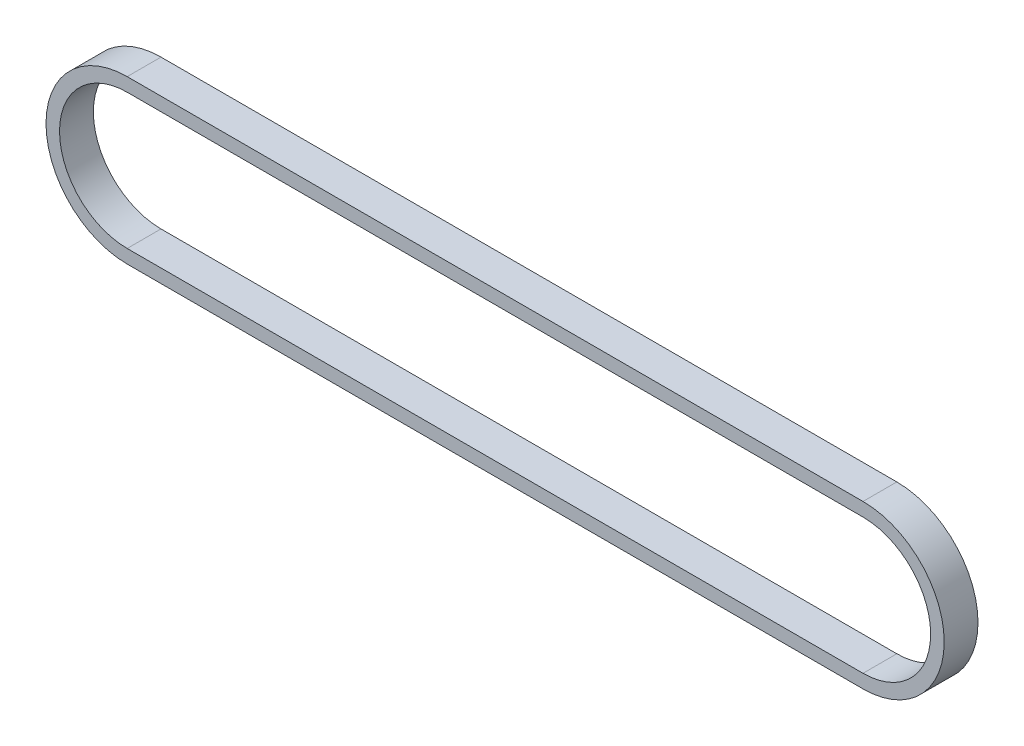
ISO-10303-21;
HEADER;
FILE_DESCRIPTION(('STEP AP214'),'2;1');
FILE_NAME('part.step','',(''),(''),'','','');
FILE_SCHEMA(('AUTOMOTIVE_DESIGN { 1 0 10303 214 1 1 1 1 }'));
ENDSEC;
DATA;
#1=APPLICATION_CONTEXT('core data for automotive mechanical design processes');
#2=APPLICATION_PROTOCOL_DEFINITION('international standard','automotive_design',2000,#1);
#3=PRODUCT_CONTEXT('',#1,'mechanical');
#4=PRODUCT('Part','Part','',(#3));
#5=PRODUCT_RELATED_PRODUCT_CATEGORY('part','',(#4));
#6=PRODUCT_DEFINITION_FORMATION('','',#4);
#7=PRODUCT_DEFINITION_CONTEXT('part definition',#1,'design');
#8=PRODUCT_DEFINITION('design','',#6,#7);
#9=PRODUCT_DEFINITION_SHAPE('','',#8);
#10=(LENGTH_UNIT() NAMED_UNIT(*) SI_UNIT(.MILLI.,.METRE.));
#11=(NAMED_UNIT(*) PLANE_ANGLE_UNIT() SI_UNIT($,.RADIAN.));
#12=(NAMED_UNIT(*) SI_UNIT($,.STERADIAN.) SOLID_ANGLE_UNIT());
#13=UNCERTAINTY_MEASURE_WITH_UNIT(LENGTH_MEASURE(1.E-05),#10,'distance_accuracy_value','');
#14=(GEOMETRIC_REPRESENTATION_CONTEXT(3) GLOBAL_UNCERTAINTY_ASSIGNED_CONTEXT((#13)) GLOBAL_UNIT_ASSIGNED_CONTEXT((#10,
#11,#12)) REPRESENTATION_CONTEXT('',''));
#15=CARTESIAN_POINT('',(0.,0.,0.));
#16=DIRECTION('',(0.,0.,1.));
#17=DIRECTION('',(1.,0.,0.));
#18=AXIS2_PLACEMENT_3D('',#15,#16,#17);
#19=CARTESIAN_POINT('',(0.,0.,6.35));
#20=DIRECTION('',(0.,0.,1.));
#21=DIRECTION('',(1.,0.,0.));
#22=AXIS2_PLACEMENT_3D('',#19,#20,#21);
#23=PLANE('',#22);
#24=CARTESIAN_POINT('',(0.,0.,6.35));
#25=DIRECTION('',(0.,0.,1.));
#26=DIRECTION('',(1.,0.,0.));
#27=AXIS2_PLACEMENT_3D('',#24,#25,#26);
#28=CIRCLE('',#27,15.24);
#29=CARTESIAN_POINT('',(0.,15.24,6.35));
#30=VERTEX_POINT('',#29);
#31=CARTESIAN_POINT('',(0.,-15.24,6.35));
#32=VERTEX_POINT('',#31);
#33=EDGE_CURVE('E157',#30,#32,#28,.T.);
#34=ORIENTED_EDGE('',*,*,#33,.T.);
#35=DIRECTION('',(1.,0.,0.));
#36=VECTOR('',#35,1.);
#37=CARTESIAN_POINT('',(0.,-15.24,6.35));
#38=LINE('',#37,#36);
#39=CARTESIAN_POINT('',(138.151108,-15.24,6.35));
#40=VERTEX_POINT('',#39);
#41=EDGE_CURVE('E161',#32,#40,#38,.T.);
#42=ORIENTED_EDGE('',*,*,#41,.T.);
#43=CARTESIAN_POINT('',(138.151108,0.,6.35));
#44=DIRECTION('',(0.,0.,1.));
#45=DIRECTION('',(1.,0.,0.));
#46=AXIS2_PLACEMENT_3D('',#43,#44,#45);
#47=CIRCLE('',#46,15.24);
#48=CARTESIAN_POINT('',(138.151108,15.24,6.35));
#49=VERTEX_POINT('',#48);
#50=EDGE_CURVE('E165',#40,#49,#47,.T.);
#51=ORIENTED_EDGE('',*,*,#50,.T.);
#52=DIRECTION('',(-1.,0.,0.));
#53=VECTOR('',#52,1.);
#54=CARTESIAN_POINT('',(0.,15.24,6.35));
#55=LINE('',#54,#53);
#56=EDGE_CURVE('E168',#49,#30,#55,.T.);
#57=ORIENTED_EDGE('',*,*,#56,.T.);
#58=EDGE_LOOP('',(#34,#42,#51,#57));
#59=FACE_BOUND('',#58,.T.);
#60=DIRECTION('',(1.,0.,0.));
#61=VECTOR('',#60,1.);
#62=CARTESIAN_POINT('',(0.,-12.7,6.35));
#63=LINE('',#62,#61);
#64=CARTESIAN_POINT('',(0.,-12.7,6.35));
#65=VERTEX_POINT('',#64);
#66=CARTESIAN_POINT('',(138.151108,-12.7,6.35));
#67=VERTEX_POINT('',#66);
#68=EDGE_CURVE('E118',#65,#67,#63,.T.);
#69=ORIENTED_EDGE('',*,*,#68,.F.);
#70=CARTESIAN_POINT('',(0.,0.,6.35));
#71=DIRECTION('',(0.,0.,1.));
#72=DIRECTION('',(1.,0.,0.));
#73=AXIS2_PLACEMENT_3D('',#70,#71,#72);
#74=CIRCLE('',#73,12.7);
#75=CARTESIAN_POINT('',(0.,12.7,6.35));
#76=VERTEX_POINT('',#75);
#77=EDGE_CURVE('E109',#76,#65,#74,.T.);
#78=ORIENTED_EDGE('',*,*,#77,.F.);
#79=DIRECTION('',(-1.,0.,0.));
#80=VECTOR('',#79,1.);
#81=CARTESIAN_POINT('',(0.,12.7,6.35));
#82=LINE('',#81,#80);
#83=CARTESIAN_POINT('',(138.151108,12.7,6.35));
#84=VERTEX_POINT('',#83);
#85=EDGE_CURVE('E135',#84,#76,#82,.T.);
#86=ORIENTED_EDGE('',*,*,#85,.F.);
#87=CARTESIAN_POINT('',(138.151108,0.,6.35));
#88=DIRECTION('',(0.,0.,1.));
#89=DIRECTION('',(1.,0.,0.));
#90=AXIS2_PLACEMENT_3D('',#87,#88,#89);
#91=CIRCLE('',#90,12.7);
#92=EDGE_CURVE('E131',#67,#84,#91,.T.);
#93=ORIENTED_EDGE('',*,*,#92,.F.);
#94=EDGE_LOOP('',(#69,#78,#86,#93));
#95=FACE_BOUND('',#94,.T.);
#96=ADVANCED_FACE('F43',(#59,#95),#23,.T.);
#97=CARTESIAN_POINT('',(0.,0.,0.));
#98=DIRECTION('',(0.,0.,1.));
#99=DIRECTION('',(1.,0.,0.));
#100=AXIS2_PLACEMENT_3D('',#97,#98,#99);
#101=PLANE('',#100);
#102=CARTESIAN_POINT('',(0.,0.,0.));
#103=DIRECTION('',(0.,0.,1.));
#104=DIRECTION('',(1.,0.,0.));
#105=AXIS2_PLACEMENT_3D('',#102,#103,#104);
#106=CIRCLE('',#105,15.24);
#107=CARTESIAN_POINT('',(0.,15.24,0.));
#108=VERTEX_POINT('',#107);
#109=CARTESIAN_POINT('',(0.,-15.24,0.));
#110=VERTEX_POINT('',#109);
#111=EDGE_CURVE('E127',#108,#110,#106,.T.);
#112=ORIENTED_EDGE('',*,*,#111,.F.);
#113=DIRECTION('',(-1.,0.,0.));
#114=VECTOR('',#113,1.);
#115=CARTESIAN_POINT('',(0.,15.24,0.));
#116=LINE('',#115,#114);
#117=CARTESIAN_POINT('',(138.151108,15.24,0.));
#118=VERTEX_POINT('',#117);
#119=EDGE_CURVE('E162',#118,#108,#116,.T.);
#120=ORIENTED_EDGE('',*,*,#119,.F.);
#121=CARTESIAN_POINT('',(138.151108,0.,0.));
#122=DIRECTION('',(0.,0.,1.));
#123=DIRECTION('',(1.,0.,0.));
#124=AXIS2_PLACEMENT_3D('',#121,#122,#123);
#125=CIRCLE('',#124,15.24);
#126=CARTESIAN_POINT('',(138.151108,-15.24,0.));
#127=VERTEX_POINT('',#126);
#128=EDGE_CURVE('E178',#127,#118,#125,.T.);
#129=ORIENTED_EDGE('',*,*,#128,.F.);
#130=DIRECTION('',(1.,0.,0.));
#131=VECTOR('',#130,1.);
#132=CARTESIAN_POINT('',(0.,-15.24,0.));
#133=LINE('',#132,#131);
#134=EDGE_CURVE('E175',#110,#127,#133,.T.);
#135=ORIENTED_EDGE('',*,*,#134,.F.);
#136=EDGE_LOOP('',(#112,#120,#129,#135));
#137=FACE_BOUND('',#136,.T.);
#138=CARTESIAN_POINT('',(0.,0.,0.));
#139=DIRECTION('',(0.,0.,1.));
#140=DIRECTION('',(1.,0.,0.));
#141=AXIS2_PLACEMENT_3D('',#138,#139,#140);
#142=CIRCLE('',#141,12.7);
#143=CARTESIAN_POINT('',(0.,12.7,0.));
#144=VERTEX_POINT('',#143);
#145=CARTESIAN_POINT('',(0.,-12.7,0.));
#146=VERTEX_POINT('',#145);
#147=EDGE_CURVE('E67',#144,#146,#142,.T.);
#148=ORIENTED_EDGE('',*,*,#147,.T.);
#149=DIRECTION('',(1.,0.,0.));
#150=VECTOR('',#149,1.);
#151=CARTESIAN_POINT('',(0.,-12.7,0.));
#152=LINE('',#151,#150);
#153=CARTESIAN_POINT('',(138.151108,-12.7,0.));
#154=VERTEX_POINT('',#153);
#155=EDGE_CURVE('E125',#146,#154,#152,.T.);
#156=ORIENTED_EDGE('',*,*,#155,.T.);
#157=CARTESIAN_POINT('',(138.151108,0.,0.));
#158=DIRECTION('',(0.,0.,1.));
#159=DIRECTION('',(1.,0.,0.));
#160=AXIS2_PLACEMENT_3D('',#157,#158,#159);
#161=CIRCLE('',#160,12.7);
#162=CARTESIAN_POINT('',(138.151108,12.7,0.));
#163=VERTEX_POINT('',#162);
#164=EDGE_CURVE('E144',#154,#163,#161,.T.);
#165=ORIENTED_EDGE('',*,*,#164,.T.);
#166=DIRECTION('',(-1.,0.,0.));
#167=VECTOR('',#166,1.);
#168=CARTESIAN_POINT('',(0.,12.7,0.));
#169=LINE('',#168,#167);
#170=EDGE_CURVE('E119',#163,#144,#169,.T.);
#171=ORIENTED_EDGE('',*,*,#170,.T.);
#172=EDGE_LOOP('',(#148,#156,#165,#171));
#173=FACE_BOUND('',#172,.T.);
#174=ADVANCED_FACE('F201',(#137,#173),#101,.F.);
#175=CARTESIAN_POINT('',(0.,0.,6.35));
#176=DIRECTION('',(0.,0.,-1.));
#177=DIRECTION('',(-1.,0.,0.));
#178=AXIS2_PLACEMENT_3D('',#175,#176,#177);
#179=CYLINDRICAL_SURFACE('',#178,15.24);
#180=ORIENTED_EDGE('',*,*,#111,.T.);
#181=DIRECTION('',(0.,0.,-1.));
#182=VECTOR('',#181,1.);
#183=CARTESIAN_POINT('',(0.,-15.24,6.35));
#184=LINE('',#183,#182);
#185=EDGE_CURVE('E11',#32,#110,#184,.T.);
#186=ORIENTED_EDGE('',*,*,#185,.F.);
#187=ORIENTED_EDGE('',*,*,#33,.F.);
#188=DIRECTION('',(0.,0.,-1.));
#189=VECTOR('',#188,1.);
#190=CARTESIAN_POINT('',(0.,15.24,6.35));
#191=LINE('',#190,#189);
#192=EDGE_CURVE('E171',#30,#108,#191,.T.);
#193=ORIENTED_EDGE('',*,*,#192,.T.);
#194=EDGE_LOOP('',(#180,#186,#187,#193));
#195=FACE_BOUND('',#194,.T.);
#196=ADVANCED_FACE('F45',(#195),#179,.T.);
#197=CARTESIAN_POINT('',(0.,-15.24,6.35));
#198=DIRECTION('',(0.,1.,0.));
#199=DIRECTION('',(0.,0.,1.));
#200=AXIS2_PLACEMENT_3D('',#197,#198,#199);
#201=PLANE('',#200);
#202=ORIENTED_EDGE('',*,*,#134,.T.);
#203=DIRECTION('',(0.,0.,-1.));
#204=VECTOR('',#203,1.);
#205=CARTESIAN_POINT('',(138.151108,-15.24,6.35));
#206=LINE('',#205,#204);
#207=EDGE_CURVE('E52',#40,#127,#206,.T.);
#208=ORIENTED_EDGE('',*,*,#207,.F.);
#209=ORIENTED_EDGE('',*,*,#41,.F.);
#210=ORIENTED_EDGE('',*,*,#185,.T.);
#211=EDGE_LOOP('',(#202,#208,#209,#210));
#212=FACE_BOUND('',#211,.T.);
#213=ADVANCED_FACE('F211',(#212),#201,.F.);
#214=CARTESIAN_POINT('',(138.151108,0.,6.35));
#215=DIRECTION('',(0.,0.,-1.));
#216=DIRECTION('',(-1.,0.,0.));
#217=AXIS2_PLACEMENT_3D('',#214,#215,#216);
#218=CYLINDRICAL_SURFACE('',#217,15.24);
#219=ORIENTED_EDGE('',*,*,#128,.T.);
#220=DIRECTION('',(0.,0.,-1.));
#221=VECTOR('',#220,1.);
#222=CARTESIAN_POINT('',(138.151108,15.24,6.35));
#223=LINE('',#222,#221);
#224=EDGE_CURVE('E186',#49,#118,#223,.T.);
#225=ORIENTED_EDGE('',*,*,#224,.F.);
#226=ORIENTED_EDGE('',*,*,#50,.F.);
#227=ORIENTED_EDGE('',*,*,#207,.T.);
#228=EDGE_LOOP('',(#219,#225,#226,#227));
#229=FACE_BOUND('',#228,.T.);
#230=ADVANCED_FACE('F195',(#229),#218,.T.);
#231=CARTESIAN_POINT('',(0.,15.24,6.35));
#232=DIRECTION('',(0.,-1.,0.));
#233=DIRECTION('',(0.,0.,-1.));
#234=AXIS2_PLACEMENT_3D('',#231,#232,#233);
#235=PLANE('',#234);
#236=ORIENTED_EDGE('',*,*,#119,.T.);
#237=ORIENTED_EDGE('',*,*,#192,.F.);
#238=ORIENTED_EDGE('',*,*,#56,.F.);
#239=ORIENTED_EDGE('',*,*,#224,.T.);
#240=EDGE_LOOP('',(#236,#237,#238,#239));
#241=FACE_BOUND('',#240,.T.);
#242=ADVANCED_FACE('F205',(#241),#235,.F.);
#243=CARTESIAN_POINT('',(0.,0.,6.35));
#244=DIRECTION('',(0.,0.,-1.));
#245=DIRECTION('',(-1.,0.,0.));
#246=AXIS2_PLACEMENT_3D('',#243,#244,#245);
#247=CYLINDRICAL_SURFACE('',#246,12.7);
#248=ORIENTED_EDGE('',*,*,#147,.F.);
#249=DIRECTION('',(0.,0.,-1.));
#250=VECTOR('',#249,1.);
#251=CARTESIAN_POINT('',(0.,12.7,6.35));
#252=LINE('',#251,#250);
#253=EDGE_CURVE('E113',#76,#144,#252,.T.);
#254=ORIENTED_EDGE('',*,*,#253,.F.);
#255=ORIENTED_EDGE('',*,*,#77,.T.);
#256=DIRECTION('',(0.,0.,-1.));
#257=VECTOR('',#256,1.);
#258=CARTESIAN_POINT('',(0.,-12.7,6.35));
#259=LINE('',#258,#257);
#260=EDGE_CURVE('E112',#65,#146,#259,.T.);
#261=ORIENTED_EDGE('',*,*,#260,.T.);
#262=EDGE_LOOP('',(#248,#254,#255,#261));
#263=FACE_BOUND('',#262,.T.);
#264=ADVANCED_FACE('F111',(#263),#247,.F.);
#265=CARTESIAN_POINT('',(0.,-12.7,6.35));
#266=DIRECTION('',(0.,1.,0.));
#267=DIRECTION('',(0.,0.,1.));
#268=AXIS2_PLACEMENT_3D('',#265,#266,#267);
#269=PLANE('',#268);
#270=ORIENTED_EDGE('',*,*,#155,.F.);
#271=ORIENTED_EDGE('',*,*,#260,.F.);
#272=ORIENTED_EDGE('',*,*,#68,.T.);
#273=DIRECTION('',(0.,0.,-1.));
#274=VECTOR('',#273,1.);
#275=CARTESIAN_POINT('',(138.151108,-12.7,6.35));
#276=LINE('',#275,#274);
#277=EDGE_CURVE('E128',#67,#154,#276,.T.);
#278=ORIENTED_EDGE('',*,*,#277,.T.);
#279=EDGE_LOOP('',(#270,#271,#272,#278));
#280=FACE_BOUND('',#279,.T.);
#281=ADVANCED_FACE('F122',(#280),#269,.T.);
#282=CARTESIAN_POINT('',(138.151108,0.,6.35));
#283=DIRECTION('',(0.,0.,-1.));
#284=DIRECTION('',(-1.,0.,0.));
#285=AXIS2_PLACEMENT_3D('',#282,#283,#284);
#286=CYLINDRICAL_SURFACE('',#285,12.7);
#287=ORIENTED_EDGE('',*,*,#164,.F.);
#288=ORIENTED_EDGE('',*,*,#277,.F.);
#289=ORIENTED_EDGE('',*,*,#92,.T.);
#290=DIRECTION('',(0.,0.,-1.));
#291=VECTOR('',#290,1.);
#292=CARTESIAN_POINT('',(138.151108,12.7,6.35));
#293=LINE('',#292,#291);
#294=EDGE_CURVE('E59',#84,#163,#293,.T.);
#295=ORIENTED_EDGE('',*,*,#294,.T.);
#296=EDGE_LOOP('',(#287,#288,#289,#295));
#297=FACE_BOUND('',#296,.T.);
#298=ADVANCED_FACE('F234',(#297),#286,.F.);
#299=CARTESIAN_POINT('',(0.,12.7,6.35));
#300=DIRECTION('',(0.,-1.,0.));
#301=DIRECTION('',(0.,0.,-1.));
#302=AXIS2_PLACEMENT_3D('',#299,#300,#301);
#303=PLANE('',#302);
#304=ORIENTED_EDGE('',*,*,#170,.F.);
#305=ORIENTED_EDGE('',*,*,#294,.F.);
#306=ORIENTED_EDGE('',*,*,#85,.T.);
#307=ORIENTED_EDGE('',*,*,#253,.T.);
#308=EDGE_LOOP('',(#304,#305,#306,#307));
#309=FACE_BOUND('',#308,.T.);
#310=ADVANCED_FACE('F238',(#309),#303,.T.);
#311=CLOSED_SHELL('',(#96,#174,#196,#213,#230,#242,#264,#281,#298,#310));
#312=MANIFOLD_SOLID_BREP('B2',#311);
#313=ADVANCED_BREP_SHAPE_REPRESENTATION('',(#18,#312),#14);
#314=SHAPE_DEFINITION_REPRESENTATION(#9,#313);
ENDSEC;
END-ISO-10303-21;
